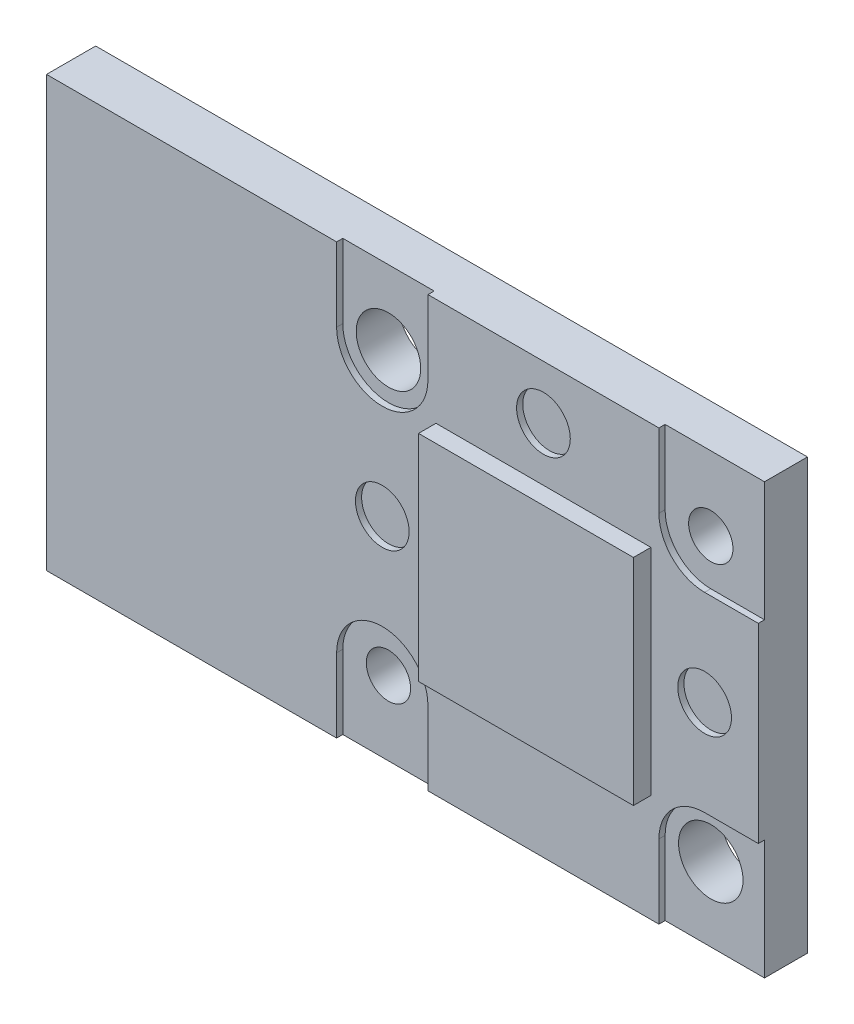
ISO-10303-21;
HEADER;
FILE_DESCRIPTION(('STEP AP214'),'2;1');
FILE_NAME('part.step','',(''),(''),'','','');
FILE_SCHEMA(('AUTOMOTIVE_DESIGN { 1 0 10303 214 1 1 1 1 }'));
ENDSEC;
DATA;
#1=APPLICATION_CONTEXT('core data for automotive mechanical design processes');
#2=APPLICATION_PROTOCOL_DEFINITION('international standard','automotive_design',2000,#1);
#3=PRODUCT_CONTEXT('',#1,'mechanical');
#4=PRODUCT('Part','Part','',(#3));
#5=PRODUCT_RELATED_PRODUCT_CATEGORY('part','',(#4));
#6=PRODUCT_DEFINITION_FORMATION('','',#4);
#7=PRODUCT_DEFINITION_CONTEXT('part definition',#1,'design');
#8=PRODUCT_DEFINITION('design','',#6,#7);
#9=PRODUCT_DEFINITION_SHAPE('','',#8);
#10=(LENGTH_UNIT() NAMED_UNIT(*) SI_UNIT(.MILLI.,.METRE.));
#11=(NAMED_UNIT(*) PLANE_ANGLE_UNIT() SI_UNIT($,.RADIAN.));
#12=(NAMED_UNIT(*) SI_UNIT($,.STERADIAN.) SOLID_ANGLE_UNIT());
#13=UNCERTAINTY_MEASURE_WITH_UNIT(LENGTH_MEASURE(1.E-05),#10,'distance_accuracy_value','');
#14=(GEOMETRIC_REPRESENTATION_CONTEXT(3) GLOBAL_UNCERTAINTY_ASSIGNED_CONTEXT((#13)) GLOBAL_UNIT_ASSIGNED_CONTEXT((#10,
#11,#12)) REPRESENTATION_CONTEXT('',''));
#15=CARTESIAN_POINT('',(0.,0.,0.));
#16=DIRECTION('',(0.,0.,1.));
#17=DIRECTION('',(1.,0.,0.));
#18=AXIS2_PLACEMENT_3D('',#15,#16,#17);
#19=CARTESIAN_POINT('',(1.25,4.,2.48));
#20=DIRECTION('',(0.,1.,0.));
#21=DIRECTION('',(0.,0.,1.));
#22=AXIS2_PLACEMENT_3D('',#19,#20,#21);
#23=PLANE('',#22);
#24=DIRECTION('',(1.,0.,0.));
#25=VECTOR('',#24,1.);
#26=CARTESIAN_POINT('',(1.25,4.,1.83));
#27=LINE('',#26,#25);
#28=CARTESIAN_POINT('',(1.25,4.,1.83));
#29=VERTEX_POINT('',#28);
#30=CARTESIAN_POINT('',(9.25,4.,1.83));
#31=VERTEX_POINT('',#30);
#32=EDGE_CURVE('E111',#29,#31,#27,.T.);
#33=ORIENTED_EDGE('',*,*,#32,.F.);
#34=DIRECTION('',(0.,0.,-1.));
#35=VECTOR('',#34,1.);
#36=CARTESIAN_POINT('',(1.25,4.,2.48));
#37=LINE('',#36,#35);
#38=CARTESIAN_POINT('',(1.25,4.,2.48));
#39=VERTEX_POINT('',#38);
#40=EDGE_CURVE('E12',#39,#29,#37,.T.);
#41=ORIENTED_EDGE('',*,*,#40,.F.);
#42=DIRECTION('',(1.,0.,0.));
#43=VECTOR('',#42,1.);
#44=CARTESIAN_POINT('',(1.25,4.,2.48));
#45=LINE('',#44,#43);
#46=CARTESIAN_POINT('',(9.25,4.,2.48));
#47=VERTEX_POINT('',#46);
#48=EDGE_CURVE('E106',#39,#47,#45,.T.);
#49=ORIENTED_EDGE('',*,*,#48,.T.);
#50=DIRECTION('',(0.,0.,-1.));
#51=VECTOR('',#50,1.);
#52=CARTESIAN_POINT('',(9.25,4.,2.48));
#53=LINE('',#52,#51);
#54=EDGE_CURVE('E49',#47,#31,#53,.T.);
#55=ORIENTED_EDGE('',*,*,#54,.T.);
#56=EDGE_LOOP('',(#33,#41,#49,#55));
#57=FACE_BOUND('',#56,.T.);
#58=ADVANCED_FACE('F46',(#57),#23,.T.);
#59=CARTESIAN_POINT('',(1.25,4.,2.48));
#60=DIRECTION('',(1.,0.,0.));
#61=DIRECTION('',(0.,1.,0.));
#62=AXIS2_PLACEMENT_3D('',#59,#60,#61);
#63=PLANE('',#62);
#64=DIRECTION('',(0.,-1.,0.));
#65=VECTOR('',#64,1.);
#66=CARTESIAN_POINT('',(1.25,4.,1.83));
#67=LINE('',#66,#65);
#68=CARTESIAN_POINT('',(1.25,-4.,1.83));
#69=VERTEX_POINT('',#68);
#70=EDGE_CURVE('E79',#29,#69,#67,.T.);
#71=ORIENTED_EDGE('',*,*,#70,.T.);
#72=DIRECTION('',(0.,0.,-1.));
#73=VECTOR('',#72,1.);
#74=CARTESIAN_POINT('',(1.25,-4.,2.48));
#75=LINE('',#74,#73);
#76=CARTESIAN_POINT('',(1.25,-4.,2.48));
#77=VERTEX_POINT('',#76);
#78=EDGE_CURVE('E55',#77,#69,#75,.T.);
#79=ORIENTED_EDGE('',*,*,#78,.F.);
#80=DIRECTION('',(0.,-1.,0.));
#81=VECTOR('',#80,1.);
#82=CARTESIAN_POINT('',(1.25,4.,2.48));
#83=LINE('',#82,#81);
#84=EDGE_CURVE('E96',#39,#77,#83,.T.);
#85=ORIENTED_EDGE('',*,*,#84,.F.);
#86=ORIENTED_EDGE('',*,*,#40,.T.);
#87=EDGE_LOOP('',(#71,#79,#85,#86));
#88=FACE_BOUND('',#87,.T.);
#89=ADVANCED_FACE('F121',(#88),#63,.F.);
#90=CARTESIAN_POINT('',(1.25,-4.,2.48));
#91=DIRECTION('',(0.,1.,0.));
#92=DIRECTION('',(0.,0.,1.));
#93=AXIS2_PLACEMENT_3D('',#90,#91,#92);
#94=PLANE('',#93);
#95=DIRECTION('',(1.,0.,0.));
#96=VECTOR('',#95,1.);
#97=CARTESIAN_POINT('',(1.25,-4.,1.83));
#98=LINE('',#97,#96);
#99=CARTESIAN_POINT('',(9.25000000000001,-4.,1.83));
#100=VERTEX_POINT('',#99);
#101=EDGE_CURVE('E103',#69,#100,#98,.T.);
#102=ORIENTED_EDGE('',*,*,#101,.T.);
#103=DIRECTION('',(0.,0.,-1.));
#104=VECTOR('',#103,1.);
#105=CARTESIAN_POINT('',(9.25000000000001,-4.,2.48));
#106=LINE('',#105,#104);
#107=CARTESIAN_POINT('',(9.25000000000001,-4.,2.48));
#108=VERTEX_POINT('',#107);
#109=EDGE_CURVE('E100',#108,#100,#106,.T.);
#110=ORIENTED_EDGE('',*,*,#109,.F.);
#111=DIRECTION('',(1.,0.,0.));
#112=VECTOR('',#111,1.);
#113=CARTESIAN_POINT('',(1.25,-4.,2.48));
#114=LINE('',#113,#112);
#115=EDGE_CURVE('E91',#77,#108,#114,.T.);
#116=ORIENTED_EDGE('',*,*,#115,.F.);
#117=ORIENTED_EDGE('',*,*,#78,.T.);
#118=EDGE_LOOP('',(#102,#110,#116,#117));
#119=FACE_BOUND('',#118,.T.);
#120=ADVANCED_FACE('F101',(#119),#94,.F.);
#121=CARTESIAN_POINT('',(9.25,4.,2.48));
#122=DIRECTION('',(1.,0.,0.));
#123=DIRECTION('',(0.,1.,0.));
#124=AXIS2_PLACEMENT_3D('',#121,#122,#123);
#125=PLANE('',#124);
#126=DIRECTION('',(0.,-1.,0.));
#127=VECTOR('',#126,1.);
#128=CARTESIAN_POINT('',(9.25,4.,1.83));
#129=LINE('',#128,#127);
#130=EDGE_CURVE('E114',#31,#100,#129,.T.);
#131=ORIENTED_EDGE('',*,*,#130,.F.);
#132=ORIENTED_EDGE('',*,*,#54,.F.);
#133=DIRECTION('',(0.,-1.,0.));
#134=VECTOR('',#133,1.);
#135=CARTESIAN_POINT('',(9.25,4.,2.48));
#136=LINE('',#135,#134);
#137=EDGE_CURVE('E95',#47,#108,#136,.T.);
#138=ORIENTED_EDGE('',*,*,#137,.T.);
#139=ORIENTED_EDGE('',*,*,#109,.T.);
#140=EDGE_LOOP('',(#131,#132,#138,#139));
#141=FACE_BOUND('',#140,.T.);
#142=ADVANCED_FACE('F105',(#141),#125,.T.);
#143=CARTESIAN_POINT('',(0.,0.,2.48));
#144=DIRECTION('',(0.,0.,-1.));
#145=DIRECTION('',(-1.,0.,0.));
#146=AXIS2_PLACEMENT_3D('',#143,#144,#145);
#147=PLANE('',#146);
#148=ORIENTED_EDGE('',*,*,#48,.F.);
#149=ORIENTED_EDGE('',*,*,#84,.T.);
#150=ORIENTED_EDGE('',*,*,#115,.T.);
#151=ORIENTED_EDGE('',*,*,#137,.F.);
#152=EDGE_LOOP('',(#148,#149,#150,#151));
#153=FACE_BOUND('',#152,.T.);
#154=ADVANCED_FACE('F94',(#153),#147,.F.);
#155=CARTESIAN_POINT('',(0.,0.,1.83));
#156=DIRECTION('',(0.,0.,-1.));
#157=DIRECTION('',(-1.,0.,0.));
#158=AXIS2_PLACEMENT_3D('',#155,#156,#157);
#159=PLANE('',#158);
#160=ORIENTED_EDGE('',*,*,#32,.T.);
#161=ORIENTED_EDGE('',*,*,#130,.T.);
#162=ORIENTED_EDGE('',*,*,#101,.F.);
#163=ORIENTED_EDGE('',*,*,#70,.F.);
#164=EDGE_LOOP('',(#160,#161,#162,#163));
#165=FACE_BOUND('',#164,.T.);
#166=ADVANCED_FACE('F119',(#165),#159,.T.);
#167=CLOSED_SHELL('',(#58,#89,#120,#142,#154,#166));
#168=MANIFOLD_SOLID_BREP('B2',#167);
#169=CARTESIAN_POINT('',(6.25,1.35,2.03));
#170=DIRECTION('',(-1.,0.,0.));
#171=DIRECTION('',(0.,0.,1.));
#172=AXIS2_PLACEMENT_3D('',#169,#170,#171);
#173=PLANE('',#172);
#174=DIRECTION('',(0.,1.,0.));
#175=VECTOR('',#174,1.);
#176=CARTESIAN_POINT('',(6.25,1.35,1.83));
#177=LINE('',#176,#175);
#178=CARTESIAN_POINT('',(6.25,-1.35,1.83));
#179=VERTEX_POINT('',#178);
#180=CARTESIAN_POINT('',(6.25,1.35,1.83));
#181=VERTEX_POINT('',#180);
#182=EDGE_CURVE('E242',#179,#181,#177,.T.);
#183=ORIENTED_EDGE('',*,*,#182,.T.);
#184=DIRECTION('',(0.,0.,-1.));
#185=VECTOR('',#184,1.);
#186=CARTESIAN_POINT('',(6.25,1.35,2.03));
#187=LINE('',#186,#185);
#188=CARTESIAN_POINT('',(6.25,1.35,2.03));
#189=VERTEX_POINT('',#188);
#190=EDGE_CURVE('E44',#189,#181,#187,.T.);
#191=ORIENTED_EDGE('',*,*,#190,.F.);
#192=DIRECTION('',(0.,1.,0.));
#193=VECTOR('',#192,1.);
#194=CARTESIAN_POINT('',(6.25,1.35,2.03));
#195=LINE('',#194,#193);
#196=CARTESIAN_POINT('',(6.25,-1.35,2.03));
#197=VERTEX_POINT('',#196);
#198=EDGE_CURVE('E230',#197,#189,#195,.T.);
#199=ORIENTED_EDGE('',*,*,#198,.F.);
#200=DIRECTION('',(0.,0.,-1.));
#201=VECTOR('',#200,1.);
#202=CARTESIAN_POINT('',(6.25,-1.35,2.03));
#203=LINE('',#202,#201);
#204=EDGE_CURVE('E238',#197,#179,#203,.T.);
#205=ORIENTED_EDGE('',*,*,#204,.T.);
#206=EDGE_LOOP('',(#183,#191,#199,#205));
#207=FACE_BOUND('',#206,.T.);
#208=ADVANCED_FACE('F179',(#207),#173,.F.);
#209=CARTESIAN_POINT('',(4.25,1.35,2.03));
#210=DIRECTION('',(0.,-1.,0.));
#211=DIRECTION('',(0.,0.,-1.));
#212=AXIS2_PLACEMENT_3D('',#209,#210,#211);
#213=PLANE('',#212);
#214=DIRECTION('',(-1.,0.,0.));
#215=VECTOR('',#214,1.);
#216=CARTESIAN_POINT('',(4.25,1.35,1.83));
#217=LINE('',#216,#215);
#218=CARTESIAN_POINT('',(4.25,1.35,1.83));
#219=VERTEX_POINT('',#218);
#220=EDGE_CURVE('E234',#181,#219,#217,.T.);
#221=ORIENTED_EDGE('',*,*,#220,.T.);
#222=DIRECTION('',(0.,0.,-1.));
#223=VECTOR('',#222,1.);
#224=CARTESIAN_POINT('',(4.25,1.35,2.03));
#225=LINE('',#224,#223);
#226=CARTESIAN_POINT('',(4.25,1.35,2.03));
#227=VERTEX_POINT('',#226);
#228=EDGE_CURVE('E187',#227,#219,#225,.T.);
#229=ORIENTED_EDGE('',*,*,#228,.F.);
#230=DIRECTION('',(-1.,0.,0.));
#231=VECTOR('',#230,1.);
#232=CARTESIAN_POINT('',(4.25,1.35,2.03));
#233=LINE('',#232,#231);
#234=EDGE_CURVE('E225',#189,#227,#233,.T.);
#235=ORIENTED_EDGE('',*,*,#234,.F.);
#236=ORIENTED_EDGE('',*,*,#190,.T.);
#237=EDGE_LOOP('',(#221,#229,#235,#236));
#238=FACE_BOUND('',#237,.T.);
#239=ADVANCED_FACE('F233',(#238),#213,.F.);
#240=CARTESIAN_POINT('',(4.25,1.35,2.03));
#241=DIRECTION('',(1.,0.,0.));
#242=DIRECTION('',(0.,0.,-1.));
#243=AXIS2_PLACEMENT_3D('',#240,#241,#242);
#244=PLANE('',#243);
#245=DIRECTION('',(0.,-1.,0.));
#246=VECTOR('',#245,1.);
#247=CARTESIAN_POINT('',(4.25,1.35,1.83));
#248=LINE('',#247,#246);
#249=CARTESIAN_POINT('',(4.25,-1.35,1.83));
#250=VERTEX_POINT('',#249);
#251=EDGE_CURVE('E212',#219,#250,#248,.T.);
#252=ORIENTED_EDGE('',*,*,#251,.T.);
#253=DIRECTION('',(0.,0.,-1.));
#254=VECTOR('',#253,1.);
#255=CARTESIAN_POINT('',(4.25,-1.35,2.03));
#256=LINE('',#255,#254);
#257=CARTESIAN_POINT('',(4.25,-1.35,2.03));
#258=VERTEX_POINT('',#257);
#259=EDGE_CURVE('E235',#258,#250,#256,.T.);
#260=ORIENTED_EDGE('',*,*,#259,.F.);
#261=DIRECTION('',(0.,-1.,0.));
#262=VECTOR('',#261,1.);
#263=CARTESIAN_POINT('',(4.25,1.35,2.03));
#264=LINE('',#263,#262);
#265=EDGE_CURVE('E228',#227,#258,#264,.T.);
#266=ORIENTED_EDGE('',*,*,#265,.F.);
#267=ORIENTED_EDGE('',*,*,#228,.T.);
#268=EDGE_LOOP('',(#252,#260,#266,#267));
#269=FACE_BOUND('',#268,.T.);
#270=ADVANCED_FACE('F236',(#269),#244,.F.);
#271=CARTESIAN_POINT('',(4.25,-1.35,2.03));
#272=DIRECTION('',(0.,1.,0.));
#273=DIRECTION('',(0.,0.,1.));
#274=AXIS2_PLACEMENT_3D('',#271,#272,#273);
#275=PLANE('',#274);
#276=DIRECTION('',(1.,0.,0.));
#277=VECTOR('',#276,1.);
#278=CARTESIAN_POINT('',(4.25,-1.35,1.83));
#279=LINE('',#278,#277);
#280=EDGE_CURVE('E218',#250,#179,#279,.T.);
#281=ORIENTED_EDGE('',*,*,#280,.T.);
#282=ORIENTED_EDGE('',*,*,#204,.F.);
#283=DIRECTION('',(1.,0.,0.));
#284=VECTOR('',#283,1.);
#285=CARTESIAN_POINT('',(4.25,-1.35,2.03));
#286=LINE('',#285,#284);
#287=EDGE_CURVE('E195',#258,#197,#286,.T.);
#288=ORIENTED_EDGE('',*,*,#287,.F.);
#289=ORIENTED_EDGE('',*,*,#259,.T.);
#290=EDGE_LOOP('',(#281,#282,#288,#289));
#291=FACE_BOUND('',#290,.T.);
#292=ADVANCED_FACE('F249',(#291),#275,.F.);
#293=CARTESIAN_POINT('',(0.,0.,2.03));
#294=DIRECTION('',(0.,0.,1.));
#295=DIRECTION('',(1.,0.,0.));
#296=AXIS2_PLACEMENT_3D('',#293,#294,#295);
#297=PLANE('',#296);
#298=ORIENTED_EDGE('',*,*,#198,.T.);
#299=ORIENTED_EDGE('',*,*,#234,.T.);
#300=ORIENTED_EDGE('',*,*,#265,.T.);
#301=ORIENTED_EDGE('',*,*,#287,.T.);
#302=EDGE_LOOP('',(#298,#299,#300,#301));
#303=FACE_BOUND('',#302,.T.);
#304=ADVANCED_FACE('F226',(#303),#297,.T.);
#305=CARTESIAN_POINT('',(0.,0.,1.83));
#306=DIRECTION('',(0.,0.,1.));
#307=DIRECTION('',(1.,0.,0.));
#308=AXIS2_PLACEMENT_3D('',#305,#306,#307);
#309=PLANE('',#308);
#310=ORIENTED_EDGE('',*,*,#182,.F.);
#311=ORIENTED_EDGE('',*,*,#280,.F.);
#312=ORIENTED_EDGE('',*,*,#251,.F.);
#313=ORIENTED_EDGE('',*,*,#220,.F.);
#314=EDGE_LOOP('',(#310,#311,#312,#313));
#315=FACE_BOUND('',#314,.T.);
#316=ADVANCED_FACE('F252',(#315),#309,.F.);
#317=CLOSED_SHELL('',(#208,#239,#270,#292,#304,#316));
#318=MANIFOLD_SOLID_BREP('B6',#317);
#319=CARTESIAN_POINT('',(0.,0.,1.6));
#320=DIRECTION('',(0.,0.,1.));
#321=DIRECTION('',(1.,0.,0.));
#322=AXIS2_PLACEMENT_3D('',#319,#320,#321);
#323=PLANE('',#322);
#324=DIRECTION('',(1.,0.,0.));
#325=VECTOR('',#324,1.);
#326=CARTESIAN_POINT('',(11.25,-3.55,1.6));
#327=LINE('',#326,#325);
#328=CARTESIAN_POINT('',(11.25,-3.55,1.6));
#329=VERTEX_POINT('',#328);
#330=CARTESIAN_POINT('',(13.25,-3.55,1.6));
#331=VERTEX_POINT('',#330);
#332=EDGE_CURVE('E318',#329,#331,#327,.T.);
#333=ORIENTED_EDGE('',*,*,#332,.F.);
#334=CARTESIAN_POINT('',(11.25,-5.25,1.6));
#335=DIRECTION('',(0.,0.,-1.));
#336=DIRECTION('',(1.,0.,0.));
#337=AXIS2_PLACEMENT_3D('',#334,#335,#336);
#338=CIRCLE('',#337,1.7);
#339=CARTESIAN_POINT('',(9.55000000000001,-5.25,1.6));
#340=VERTEX_POINT('',#339);
#341=EDGE_CURVE('E322',#340,#329,#338,.T.);
#342=ORIENTED_EDGE('',*,*,#341,.F.);
#343=DIRECTION('',(0.,1.,0.));
#344=VECTOR('',#343,1.);
#345=CARTESIAN_POINT('',(9.55000000000001,-5.25,1.6));
#346=LINE('',#345,#344);
#347=CARTESIAN_POINT('',(9.55000000000001,-8.,1.6));
#348=VERTEX_POINT('',#347);
#349=EDGE_CURVE('E552',#348,#340,#346,.T.);
#350=ORIENTED_EDGE('',*,*,#349,.F.);
#351=DIRECTION('',(1.,0.,0.));
#352=VECTOR('',#351,1.);
#353=CARTESIAN_POINT('',(-13.25,-8.,1.6));
#354=LINE('',#353,#352);
#355=CARTESIAN_POINT('',(13.25,-8.,1.6));
#356=VERTEX_POINT('',#355);
#357=EDGE_CURVE('E500',#348,#356,#354,.T.);
#358=ORIENTED_EDGE('',*,*,#357,.T.);
#359=DIRECTION('',(0.,1.,0.));
#360=VECTOR('',#359,1.);
#361=CARTESIAN_POINT('',(13.25,8.,1.6));
#362=LINE('',#361,#360);
#363=EDGE_CURVE('E494',#356,#331,#362,.T.);
#364=ORIENTED_EDGE('',*,*,#363,.T.);
#365=EDGE_LOOP('',(#333,#342,#350,#358,#364));
#366=FACE_BOUND('',#365,.T.);
#367=CARTESIAN_POINT('',(11.25,-5.25,1.6));
#368=DIRECTION('',(0.,0.,1.));
#369=DIRECTION('',(1.,0.,0.));
#370=AXIS2_PLACEMENT_3D('',#367,#368,#369);
#371=CIRCLE('',#370,1.2);
#372=CARTESIAN_POINT('',(12.45,-5.25,1.6));
#373=VERTEX_POINT('',#372);
#374=EDGE_CURVE('E483',#373,#373,#371,.T.);
#375=ORIENTED_EDGE('',*,*,#374,.F.);
#376=EDGE_LOOP('',(#375));
#377=FACE_BOUND('',#376,.T.);
#378=ADVANCED_FACE('F303',(#366,#377),#323,.T.);
#379=DIRECTION('',(0.,-1.,0.));
#380=VECTOR('',#379,1.);
#381=CARTESIAN_POINT('',(0.950000000000006,-5.25,1.6));
#382=LINE('',#381,#380);
#383=CARTESIAN_POINT('',(0.950000000000006,-5.25,1.6));
#384=VERTEX_POINT('',#383);
#385=CARTESIAN_POINT('',(0.950000000000006,-8.,1.6));
#386=VERTEX_POINT('',#385);
#387=EDGE_CURVE('E622',#384,#386,#382,.T.);
#388=ORIENTED_EDGE('',*,*,#387,.F.);
#389=CARTESIAN_POINT('',(-0.749999999999994,-5.25,1.6));
#390=DIRECTION('',(0.,0.,-1.));
#391=DIRECTION('',(1.,0.,0.));
#392=AXIS2_PLACEMENT_3D('',#389,#390,#391);
#393=CIRCLE('',#392,1.7);
#394=CARTESIAN_POINT('',(-2.44999999999999,-5.25,1.6));
#395=VERTEX_POINT('',#394);
#396=EDGE_CURVE('E615',#395,#384,#393,.T.);
#397=ORIENTED_EDGE('',*,*,#396,.F.);
#398=DIRECTION('',(0.,1.,0.));
#399=VECTOR('',#398,1.);
#400=CARTESIAN_POINT('',(-2.44999999999999,-5.25,1.6));
#401=LINE('',#400,#399);
#402=CARTESIAN_POINT('',(-2.44999999999999,-8.,1.6));
#403=VERTEX_POINT('',#402);
#404=EDGE_CURVE('E611',#403,#395,#401,.T.);
#405=ORIENTED_EDGE('',*,*,#404,.F.);
#406=EDGE_CURVE('E502',#403,#386,#354,.T.);
#407=ORIENTED_EDGE('',*,*,#406,.T.);
#408=EDGE_LOOP('',(#388,#397,#405,#407));
#409=FACE_BOUND('',#408,.T.);
#410=CARTESIAN_POINT('',(-0.749999999999994,-5.25,1.6));
#411=DIRECTION('',(0.,0.,1.));
#412=DIRECTION('',(1.,0.,0.));
#413=AXIS2_PLACEMENT_3D('',#410,#411,#412);
#414=CIRCLE('',#413,0.825);
#415=CARTESIAN_POINT('',(0.075000000000006,-5.25,1.6));
#416=VERTEX_POINT('',#415);
#417=EDGE_CURVE('E464',#416,#416,#414,.T.);
#418=ORIENTED_EDGE('',*,*,#417,.F.);
#419=EDGE_LOOP('',(#418));
#420=FACE_BOUND('',#419,.T.);
#421=ADVANCED_FACE('F676',(#409,#420),#323,.T.);
#422=DIRECTION('',(0.,1.,0.));
#423=VECTOR('',#422,1.);
#424=CARTESIAN_POINT('',(-2.45,5.25,1.6));
#425=LINE('',#424,#423);
#426=CARTESIAN_POINT('',(-2.45,5.25,1.6));
#427=VERTEX_POINT('',#426);
#428=CARTESIAN_POINT('',(-2.45,8.,1.6));
#429=VERTEX_POINT('',#428);
#430=EDGE_CURVE('E605',#427,#429,#425,.T.);
#431=ORIENTED_EDGE('',*,*,#430,.F.);
#432=CARTESIAN_POINT('',(-0.749999999999995,5.25,1.6));
#433=DIRECTION('',(0.,0.,-1.));
#434=DIRECTION('',(1.,0.,0.));
#435=AXIS2_PLACEMENT_3D('',#432,#433,#434);
#436=CIRCLE('',#435,1.7);
#437=CARTESIAN_POINT('',(0.950000000000005,5.25,1.6));
#438=VERTEX_POINT('',#437);
#439=EDGE_CURVE('E612',#438,#427,#436,.T.);
#440=ORIENTED_EDGE('',*,*,#439,.F.);
#441=DIRECTION('',(0.,-1.,0.));
#442=VECTOR('',#441,1.);
#443=CARTESIAN_POINT('',(0.950000000000005,5.25,1.6));
#444=LINE('',#443,#442);
#445=CARTESIAN_POINT('',(0.950000000000005,8.,1.6));
#446=VERTEX_POINT('',#445);
#447=EDGE_CURVE('E596',#446,#438,#444,.T.);
#448=ORIENTED_EDGE('',*,*,#447,.F.);
#449=DIRECTION('',(-1.,0.,0.));
#450=VECTOR('',#449,1.);
#451=CARTESIAN_POINT('',(-13.25,8.,1.6));
#452=LINE('',#451,#450);
#453=EDGE_CURVE('E496',#446,#429,#452,.T.);
#454=ORIENTED_EDGE('',*,*,#453,.T.);
#455=EDGE_LOOP('',(#431,#440,#448,#454));
#456=FACE_BOUND('',#455,.T.);
#457=CARTESIAN_POINT('',(-0.749999999999995,5.25,1.6));
#458=DIRECTION('',(0.,0.,1.));
#459=DIRECTION('',(1.,0.,0.));
#460=AXIS2_PLACEMENT_3D('',#457,#458,#459);
#461=CIRCLE('',#460,1.2);
#462=CARTESIAN_POINT('',(0.450000000000005,5.25,1.6));
#463=VERTEX_POINT('',#462);
#464=EDGE_CURVE('E477',#463,#463,#461,.T.);
#465=ORIENTED_EDGE('',*,*,#464,.F.);
#466=EDGE_LOOP('',(#465));
#467=FACE_BOUND('',#466,.T.);
#468=ADVANCED_FACE('F603',(#456,#467),#323,.T.);
#469=CARTESIAN_POINT('',(13.25,8.,1.6));
#470=DIRECTION('',(-1.,0.,0.));
#471=DIRECTION('',(0.,0.,1.));
#472=AXIS2_PLACEMENT_3D('',#469,#470,#471);
#473=PLANE('',#472);
#474=DIRECTION('',(0.,1.,0.));
#475=VECTOR('',#474,1.);
#476=CARTESIAN_POINT('',(13.25,8.,0.));
#477=LINE('',#476,#475);
#478=CARTESIAN_POINT('',(13.25,-8.,0.));
#479=VERTEX_POINT('',#478);
#480=CARTESIAN_POINT('',(13.25,8.,0.));
#481=VERTEX_POINT('',#480);
#482=EDGE_CURVE('E491',#479,#481,#477,.T.);
#483=ORIENTED_EDGE('',*,*,#482,.T.);
#484=DIRECTION('',(0.,0.,-1.));
#485=VECTOR('',#484,1.);
#486=CARTESIAN_POINT('',(13.25,8.,1.6));
#487=LINE('',#486,#485);
#488=CARTESIAN_POINT('',(13.25,8.,1.6));
#489=VERTEX_POINT('',#488);
#490=EDGE_CURVE('E177',#489,#481,#487,.T.);
#491=ORIENTED_EDGE('',*,*,#490,.F.);
#492=CARTESIAN_POINT('',(13.25,3.55,1.6));
#493=VERTEX_POINT('',#492);
#494=EDGE_CURVE('E497',#493,#489,#362,.T.);
#495=ORIENTED_EDGE('',*,*,#494,.F.);
#496=DIRECTION('',(0.,0.,-1.));
#497=VECTOR('',#496,1.);
#498=CARTESIAN_POINT('',(13.25,3.55,1.83));
#499=LINE('',#498,#497);
#500=CARTESIAN_POINT('',(13.25,3.55,1.83));
#501=VERTEX_POINT('',#500);
#502=EDGE_CURVE('E558',#501,#493,#499,.T.);
#503=ORIENTED_EDGE('',*,*,#502,.F.);
#504=DIRECTION('',(0.,1.,0.));
#505=VECTOR('',#504,1.);
#506=CARTESIAN_POINT('',(13.25,-3.55,1.83));
#507=LINE('',#506,#505);
#508=CARTESIAN_POINT('',(13.25,-3.55,1.83));
#509=VERTEX_POINT('',#508);
#510=EDGE_CURVE('E636',#509,#501,#507,.T.);
#511=ORIENTED_EDGE('',*,*,#510,.F.);
#512=DIRECTION('',(0.,0.,-1.));
#513=VECTOR('',#512,1.);
#514=CARTESIAN_POINT('',(13.25,-3.55,1.83));
#515=LINE('',#514,#513);
#516=EDGE_CURVE('E541',#509,#331,#515,.T.);
#517=ORIENTED_EDGE('',*,*,#516,.T.);
#518=ORIENTED_EDGE('',*,*,#363,.F.);
#519=DIRECTION('',(0.,0.,-1.));
#520=VECTOR('',#519,1.);
#521=CARTESIAN_POINT('',(13.25,-8.,1.6));
#522=LINE('',#521,#520);
#523=EDGE_CURVE('E511',#356,#479,#522,.T.);
#524=ORIENTED_EDGE('',*,*,#523,.T.);
#525=EDGE_LOOP('',(#483,#491,#495,#503,#511,#517,#518,#524));
#526=FACE_BOUND('',#525,.T.);
#527=ADVANCED_FACE('F305',(#526),#473,.F.);
#528=CARTESIAN_POINT('',(-13.25,8.,1.6));
#529=DIRECTION('',(0.,-1.,0.));
#530=DIRECTION('',(0.,0.,-1.));
#531=AXIS2_PLACEMENT_3D('',#528,#529,#530);
#532=PLANE('',#531);
#533=DIRECTION('',(-1.,0.,0.));
#534=VECTOR('',#533,1.);
#535=CARTESIAN_POINT('',(-13.25,8.,0.));
#536=LINE('',#535,#534);
#537=CARTESIAN_POINT('',(-13.25,8.,0.));
#538=VERTEX_POINT('',#537);
#539=EDGE_CURVE('E505',#481,#538,#536,.T.);
#540=ORIENTED_EDGE('',*,*,#539,.T.);
#541=DIRECTION('',(0.,0.,-1.));
#542=VECTOR('',#541,1.);
#543=CARTESIAN_POINT('',(-13.25,8.,1.6));
#544=LINE('',#543,#542);
#545=CARTESIAN_POINT('',(-13.25,8.,1.83));
#546=VERTEX_POINT('',#545);
#547=EDGE_CURVE('E311',#546,#538,#544,.T.);
#548=ORIENTED_EDGE('',*,*,#547,.F.);
#549=DIRECTION('',(-1.,0.,0.));
#550=VECTOR('',#549,1.);
#551=CARTESIAN_POINT('',(-2.45,8.,1.83));
#552=LINE('',#551,#550);
#553=CARTESIAN_POINT('',(-2.45,8.,1.83));
#554=VERTEX_POINT('',#553);
#555=EDGE_CURVE('E724',#554,#546,#552,.T.);
#556=ORIENTED_EDGE('',*,*,#555,.F.);
#557=DIRECTION('',(0.,0.,-1.));
#558=VECTOR('',#557,1.);
#559=CARTESIAN_POINT('',(-2.45,8.,1.83));
#560=LINE('',#559,#558);
#561=EDGE_CURVE('E581',#554,#429,#560,.T.);
#562=ORIENTED_EDGE('',*,*,#561,.T.);
#563=ORIENTED_EDGE('',*,*,#453,.F.);
#564=DIRECTION('',(0.,0.,-1.));
#565=VECTOR('',#564,1.);
#566=CARTESIAN_POINT('',(0.950000000000005,8.,1.83));
#567=LINE('',#566,#565);
#568=CARTESIAN_POINT('',(0.950000000000005,8.,1.83));
#569=VERTEX_POINT('',#568);
#570=EDGE_CURVE('E469',#569,#446,#567,.T.);
#571=ORIENTED_EDGE('',*,*,#570,.F.);
#572=DIRECTION('',(-1.,0.,0.));
#573=VECTOR('',#572,1.);
#574=CARTESIAN_POINT('',(0.950000000000005,8.,1.83));
#575=LINE('',#574,#573);
#576=CARTESIAN_POINT('',(9.55000000000001,8.,1.83));
#577=VERTEX_POINT('',#576);
#578=EDGE_CURVE('E449',#577,#569,#575,.T.);
#579=ORIENTED_EDGE('',*,*,#578,.F.);
#580=DIRECTION('',(0.,0.,-1.));
#581=VECTOR('',#580,1.);
#582=CARTESIAN_POINT('',(9.55000000000001,8.,1.83));
#583=LINE('',#582,#581);
#584=CARTESIAN_POINT('',(9.55000000000001,8.,1.6));
#585=VERTEX_POINT('',#584);
#586=EDGE_CURVE('E446',#577,#585,#583,.T.);
#587=ORIENTED_EDGE('',*,*,#586,.T.);
#588=EDGE_CURVE('E498',#489,#585,#452,.T.);
#589=ORIENTED_EDGE('',*,*,#588,.F.);
#590=ORIENTED_EDGE('',*,*,#490,.T.);
#591=EDGE_LOOP('',(#540,#548,#556,#562,#563,#571,#579,#587,#589,#590));
#592=FACE_BOUND('',#591,.T.);
#593=ADVANCED_FACE('F599',(#592),#532,.F.);
#594=CARTESIAN_POINT('',(-13.25,8.,1.6));
#595=DIRECTION('',(1.,0.,0.));
#596=DIRECTION('',(0.,1.,0.));
#597=AXIS2_PLACEMENT_3D('',#594,#595,#596);
#598=PLANE('',#597);
#599=DIRECTION('',(0.,-1.,0.));
#600=VECTOR('',#599,1.);
#601=CARTESIAN_POINT('',(-13.25,8.,0.));
#602=LINE('',#601,#600);
#603=CARTESIAN_POINT('',(-13.25,-8.,0.));
#604=VERTEX_POINT('',#603);
#605=EDGE_CURVE('E507',#538,#604,#602,.T.);
#606=ORIENTED_EDGE('',*,*,#605,.T.);
#607=DIRECTION('',(0.,0.,-1.));
#608=VECTOR('',#607,1.);
#609=CARTESIAN_POINT('',(-13.25,-8.,1.6));
#610=LINE('',#609,#608);
#611=CARTESIAN_POINT('',(-13.25,-8.,1.83));
#612=VERTEX_POINT('',#611);
#613=EDGE_CURVE('E514',#612,#604,#610,.T.);
#614=ORIENTED_EDGE('',*,*,#613,.F.);
#615=DIRECTION('',(0.,-1.,0.));
#616=VECTOR('',#615,1.);
#617=CARTESIAN_POINT('',(-13.25,8.,1.83));
#618=LINE('',#617,#616);
#619=EDGE_CURVE('E522',#546,#612,#618,.T.);
#620=ORIENTED_EDGE('',*,*,#619,.F.);
#621=ORIENTED_EDGE('',*,*,#547,.T.);
#622=EDGE_LOOP('',(#606,#614,#620,#621));
#623=FACE_BOUND('',#622,.T.);
#624=ADVANCED_FACE('F520',(#623),#598,.F.);
#625=CARTESIAN_POINT('',(-13.25,-8.,1.6));
#626=DIRECTION('',(0.,1.,0.));
#627=DIRECTION('',(0.,0.,1.));
#628=AXIS2_PLACEMENT_3D('',#625,#626,#627);
#629=PLANE('',#628);
#630=DIRECTION('',(1.,0.,0.));
#631=VECTOR('',#630,1.);
#632=CARTESIAN_POINT('',(-13.25,-8.,0.));
#633=LINE('',#632,#631);
#634=EDGE_CURVE('E509',#604,#479,#633,.T.);
#635=ORIENTED_EDGE('',*,*,#634,.T.);
#636=ORIENTED_EDGE('',*,*,#523,.F.);
#637=ORIENTED_EDGE('',*,*,#357,.F.);
#638=DIRECTION('',(0.,0.,-1.));
#639=VECTOR('',#638,1.);
#640=CARTESIAN_POINT('',(9.55000000000001,-8.,1.83));
#641=LINE('',#640,#639);
#642=CARTESIAN_POINT('',(9.55000000000001,-8.,1.83));
#643=VERTEX_POINT('',#642);
#644=EDGE_CURVE('E566',#643,#348,#641,.T.);
#645=ORIENTED_EDGE('',*,*,#644,.F.);
#646=DIRECTION('',(1.,0.,0.));
#647=VECTOR('',#646,1.);
#648=CARTESIAN_POINT('',(9.55000000000001,-8.,1.83));
#649=LINE('',#648,#647);
#650=CARTESIAN_POINT('',(0.950000000000006,-8.,1.83));
#651=VERTEX_POINT('',#650);
#652=EDGE_CURVE('E638',#651,#643,#649,.T.);
#653=ORIENTED_EDGE('',*,*,#652,.F.);
#654=DIRECTION('',(0.,0.,-1.));
#655=VECTOR('',#654,1.);
#656=CARTESIAN_POINT('',(0.950000000000006,-8.,1.83));
#657=LINE('',#656,#655);
#658=EDGE_CURVE('E569',#651,#386,#657,.T.);
#659=ORIENTED_EDGE('',*,*,#658,.T.);
#660=ORIENTED_EDGE('',*,*,#406,.F.);
#661=DIRECTION('',(0.,0.,-1.));
#662=VECTOR('',#661,1.);
#663=CARTESIAN_POINT('',(-2.44999999999999,-8.,1.83));
#664=LINE('',#663,#662);
#665=CARTESIAN_POINT('',(-2.44999999999999,-8.,1.83));
#666=VERTEX_POINT('',#665);
#667=EDGE_CURVE('E578',#666,#403,#664,.T.);
#668=ORIENTED_EDGE('',*,*,#667,.F.);
#669=DIRECTION('',(1.,0.,0.));
#670=VECTOR('',#669,1.);
#671=CARTESIAN_POINT('',(-13.25,-8.,1.83));
#672=LINE('',#671,#670);
#673=EDGE_CURVE('E727',#612,#666,#672,.T.);
#674=ORIENTED_EDGE('',*,*,#673,.F.);
#675=ORIENTED_EDGE('',*,*,#613,.T.);
#676=EDGE_LOOP('',(#635,#636,#637,#645,#653,#659,#660,#668,#674,#675));
#677=FACE_BOUND('',#676,.T.);
#678=ADVANCED_FACE('F532',(#677),#629,.F.);
#679=DIRECTION('',(-1.,0.,0.));
#680=VECTOR('',#679,1.);
#681=CARTESIAN_POINT('',(11.25,3.55,1.6));
#682=LINE('',#681,#680);
#683=CARTESIAN_POINT('',(11.25,3.55,1.6));
#684=VERTEX_POINT('',#683);
#685=EDGE_CURVE('E460',#493,#684,#682,.T.);
#686=ORIENTED_EDGE('',*,*,#685,.F.);
#687=ORIENTED_EDGE('',*,*,#494,.T.);
#688=ORIENTED_EDGE('',*,*,#588,.T.);
#689=DIRECTION('',(0.,1.,0.));
#690=VECTOR('',#689,1.);
#691=CARTESIAN_POINT('',(9.55000000000001,5.25,1.6));
#692=LINE('',#691,#690);
#693=CARTESIAN_POINT('',(9.55000000000001,5.25,1.6));
#694=VERTEX_POINT('',#693);
#695=EDGE_CURVE('E645',#694,#585,#692,.T.);
#696=ORIENTED_EDGE('',*,*,#695,.F.);
#697=CARTESIAN_POINT('',(11.25,5.25,1.6));
#698=DIRECTION('',(0.,0.,-1.));
#699=DIRECTION('',(1.,0.,0.));
#700=AXIS2_PLACEMENT_3D('',#697,#698,#699);
#701=CIRCLE('',#700,1.7);
#702=EDGE_CURVE('E463',#684,#694,#701,.T.);
#703=ORIENTED_EDGE('',*,*,#702,.F.);
#704=EDGE_LOOP('',(#686,#687,#688,#696,#703));
#705=FACE_BOUND('',#704,.T.);
#706=CARTESIAN_POINT('',(11.25,5.25,1.6));
#707=DIRECTION('',(0.,0.,1.));
#708=DIRECTION('',(1.,0.,0.));
#709=AXIS2_PLACEMENT_3D('',#706,#707,#708);
#710=CIRCLE('',#709,0.825);
#711=CARTESIAN_POINT('',(12.075,5.25,1.6));
#712=VERTEX_POINT('',#711);
#713=EDGE_CURVE('E476',#712,#712,#710,.T.);
#714=ORIENTED_EDGE('',*,*,#713,.F.);
#715=EDGE_LOOP('',(#714));
#716=FACE_BOUND('',#715,.T.);
#717=ADVANCED_FACE('F653',(#705,#716),#323,.T.);
#718=CARTESIAN_POINT('',(0.,0.,0.));
#719=DIRECTION('',(0.,0.,1.));
#720=DIRECTION('',(1.,0.,0.));
#721=AXIS2_PLACEMENT_3D('',#718,#719,#720);
#722=PLANE('',#721);
#723=CARTESIAN_POINT('',(-0.749999999999995,5.25,0.));
#724=DIRECTION('',(0.,0.,1.));
#725=DIRECTION('',(1.,0.,0.));
#726=AXIS2_PLACEMENT_3D('',#723,#724,#725);
#727=CIRCLE('',#726,1.2);
#728=CARTESIAN_POINT('',(0.450000000000005,5.25,0.));
#729=VERTEX_POINT('',#728);
#730=EDGE_CURVE('E473',#729,#729,#727,.T.);
#731=ORIENTED_EDGE('',*,*,#730,.T.);
#732=EDGE_LOOP('',(#731));
#733=FACE_BOUND('',#732,.T.);
#734=CARTESIAN_POINT('',(11.25,-5.25,0.));
#735=DIRECTION('',(0.,0.,1.));
#736=DIRECTION('',(1.,0.,0.));
#737=AXIS2_PLACEMENT_3D('',#734,#735,#736);
#738=CIRCLE('',#737,1.2);
#739=CARTESIAN_POINT('',(12.45,-5.25,0.));
#740=VERTEX_POINT('',#739);
#741=EDGE_CURVE('E480',#740,#740,#738,.T.);
#742=ORIENTED_EDGE('',*,*,#741,.T.);
#743=EDGE_LOOP('',(#742));
#744=FACE_BOUND('',#743,.T.);
#745=CARTESIAN_POINT('',(-0.749999999999994,-5.25,0.));
#746=DIRECTION('',(0.,0.,1.));
#747=DIRECTION('',(1.,0.,0.));
#748=AXIS2_PLACEMENT_3D('',#745,#746,#747);
#749=CIRCLE('',#748,0.825);
#750=CARTESIAN_POINT('',(0.075000000000006,-5.25,0.));
#751=VERTEX_POINT('',#750);
#752=EDGE_CURVE('E467',#751,#751,#749,.T.);
#753=ORIENTED_EDGE('',*,*,#752,.T.);
#754=EDGE_LOOP('',(#753));
#755=FACE_BOUND('',#754,.T.);
#756=CARTESIAN_POINT('',(11.25,5.25,0.));
#757=DIRECTION('',(0.,0.,1.));
#758=DIRECTION('',(1.,0.,0.));
#759=AXIS2_PLACEMENT_3D('',#756,#757,#758);
#760=CIRCLE('',#759,0.825);
#761=CARTESIAN_POINT('',(12.075,5.25,0.));
#762=VERTEX_POINT('',#761);
#763=EDGE_CURVE('E488',#762,#762,#760,.T.);
#764=ORIENTED_EDGE('',*,*,#763,.T.);
#765=EDGE_LOOP('',(#764));
#766=FACE_BOUND('',#765,.T.);
#767=ORIENTED_EDGE('',*,*,#482,.F.);
#768=ORIENTED_EDGE('',*,*,#634,.F.);
#769=ORIENTED_EDGE('',*,*,#605,.F.);
#770=ORIENTED_EDGE('',*,*,#539,.F.);
#771=EDGE_LOOP('',(#767,#768,#769,#770));
#772=FACE_BOUND('',#771,.T.);
#773=ADVANCED_FACE('F529',(#733,#744,#755,#766,#772),#722,.F.);
#774=CARTESIAN_POINT('',(11.25,5.25,0.));
#775=DIRECTION('',(0.,0.,1.));
#776=DIRECTION('',(1.,0.,0.));
#777=AXIS2_PLACEMENT_3D('',#774,#775,#776);
#778=CYLINDRICAL_SURFACE('',#777,0.825);
#779=ORIENTED_EDGE('',*,*,#763,.F.);
#780=EDGE_LOOP('',(#779));
#781=FACE_BOUND('',#780,.T.);
#782=ORIENTED_EDGE('',*,*,#713,.T.);
#783=EDGE_LOOP('',(#782));
#784=FACE_BOUND('',#783,.T.);
#785=ADVANCED_FACE('F660',(#781,#784),#778,.F.);
#786=CARTESIAN_POINT('',(-0.749999999999994,-5.25,0.));
#787=DIRECTION('',(0.,0.,1.));
#788=DIRECTION('',(1.,0.,0.));
#789=AXIS2_PLACEMENT_3D('',#786,#787,#788);
#790=CYLINDRICAL_SURFACE('',#789,0.825);
#791=ORIENTED_EDGE('',*,*,#752,.F.);
#792=EDGE_LOOP('',(#791));
#793=FACE_BOUND('',#792,.T.);
#794=ORIENTED_EDGE('',*,*,#417,.T.);
#795=EDGE_LOOP('',(#794));
#796=FACE_BOUND('',#795,.T.);
#797=ADVANCED_FACE('F662',(#793,#796),#790,.F.);
#798=CARTESIAN_POINT('',(11.25,-5.25,0.));
#799=DIRECTION('',(0.,0.,1.));
#800=DIRECTION('',(1.,0.,0.));
#801=AXIS2_PLACEMENT_3D('',#798,#799,#800);
#802=CYLINDRICAL_SURFACE('',#801,1.2);
#803=ORIENTED_EDGE('',*,*,#741,.F.);
#804=EDGE_LOOP('',(#803));
#805=FACE_BOUND('',#804,.T.);
#806=ORIENTED_EDGE('',*,*,#374,.T.);
#807=EDGE_LOOP('',(#806));
#808=FACE_BOUND('',#807,.T.);
#809=ADVANCED_FACE('F669',(#805,#808),#802,.F.);
#810=CARTESIAN_POINT('',(-0.749999999999995,5.25,0.));
#811=DIRECTION('',(0.,0.,1.));
#812=DIRECTION('',(1.,0.,0.));
#813=AXIS2_PLACEMENT_3D('',#810,#811,#812);
#814=CYLINDRICAL_SURFACE('',#813,1.2);
#815=ORIENTED_EDGE('',*,*,#730,.F.);
#816=EDGE_LOOP('',(#815));
#817=FACE_BOUND('',#816,.T.);
#818=ORIENTED_EDGE('',*,*,#464,.T.);
#819=EDGE_LOOP('',(#818));
#820=FACE_BOUND('',#819,.T.);
#821=ADVANCED_FACE('F767',(#817,#820),#814,.F.);
#822=CARTESIAN_POINT('',(11.25,5.25,1.83));
#823=DIRECTION('',(0.,0.,1.));
#824=DIRECTION('',(1.,0.,0.));
#825=AXIS2_PLACEMENT_3D('',#822,#823,#824);
#826=PLANE('',#825);
#827=CARTESIAN_POINT('',(5.25,6.,1.83));
#828=DIRECTION('',(0.,0.,1.));
#829=DIRECTION('',(1.,0.,0.));
#830=AXIS2_PLACEMENT_3D('',#827,#828,#829);
#831=CIRCLE('',#830,1.);
#832=CARTESIAN_POINT('',(6.25,6.,1.83));
#833=VERTEX_POINT('',#832);
#834=EDGE_CURVE('E709',#833,#833,#831,.T.);
#835=ORIENTED_EDGE('',*,*,#834,.F.);
#836=EDGE_LOOP('',(#835));
#837=FACE_BOUND('',#836,.T.);
#838=CARTESIAN_POINT('',(11.25,5.25,1.83));
#839=DIRECTION('',(0.,0.,-1.));
#840=DIRECTION('',(1.,0.,0.));
#841=AXIS2_PLACEMENT_3D('',#838,#839,#840);
#842=CIRCLE('',#841,1.7);
#843=CARTESIAN_POINT('',(11.25,3.55,1.83));
#844=VERTEX_POINT('',#843);
#845=CARTESIAN_POINT('',(9.55000000000001,5.25,1.83));
#846=VERTEX_POINT('',#845);
#847=EDGE_CURVE('E450',#844,#846,#842,.T.);
#848=ORIENTED_EDGE('',*,*,#847,.T.);
#849=DIRECTION('',(0.,1.,0.));
#850=VECTOR('',#849,1.);
#851=CARTESIAN_POINT('',(9.55000000000001,5.25,1.83));
#852=LINE('',#851,#850);
#853=EDGE_CURVE('E438',#846,#577,#852,.T.);
#854=ORIENTED_EDGE('',*,*,#853,.T.);
#855=ORIENTED_EDGE('',*,*,#578,.T.);
#856=DIRECTION('',(0.,-1.,0.));
#857=VECTOR('',#856,1.);
#858=CARTESIAN_POINT('',(0.950000000000005,5.25,1.83));
#859=LINE('',#858,#857);
#860=CARTESIAN_POINT('',(0.950000000000005,5.25,1.83));
#861=VERTEX_POINT('',#860);
#862=EDGE_CURVE('E597',#569,#861,#859,.T.);
#863=ORIENTED_EDGE('',*,*,#862,.T.);
#864=CARTESIAN_POINT('',(-0.749999999999995,5.25,1.83));
#865=DIRECTION('',(0.,0.,-1.));
#866=DIRECTION('',(1.,0.,0.));
#867=AXIS2_PLACEMENT_3D('',#864,#865,#866);
#868=CIRCLE('',#867,1.7);
#869=CARTESIAN_POINT('',(-2.45,5.25,1.83));
#870=VERTEX_POINT('',#869);
#871=EDGE_CURVE('E720',#861,#870,#868,.T.);
#872=ORIENTED_EDGE('',*,*,#871,.T.);
#873=DIRECTION('',(0.,1.,0.));
#874=VECTOR('',#873,1.);
#875=CARTESIAN_POINT('',(-2.45,5.25,1.83));
#876=LINE('',#875,#874);
#877=EDGE_CURVE('E722',#870,#554,#876,.T.);
#878=ORIENTED_EDGE('',*,*,#877,.T.);
#879=ORIENTED_EDGE('',*,*,#555,.T.);
#880=ORIENTED_EDGE('',*,*,#619,.T.);
#881=ORIENTED_EDGE('',*,*,#673,.T.);
#882=DIRECTION('',(0.,1.,0.));
#883=VECTOR('',#882,1.);
#884=CARTESIAN_POINT('',(-2.44999999999999,-5.25,1.83));
#885=LINE('',#884,#883);
#886=CARTESIAN_POINT('',(-2.44999999999999,-5.25,1.83));
#887=VERTEX_POINT('',#886);
#888=EDGE_CURVE('E729',#666,#887,#885,.T.);
#889=ORIENTED_EDGE('',*,*,#888,.T.);
#890=CARTESIAN_POINT('',(-0.749999999999994,-5.25,1.83));
#891=DIRECTION('',(0.,0.,-1.));
#892=DIRECTION('',(1.,0.,0.));
#893=AXIS2_PLACEMENT_3D('',#890,#891,#892);
#894=CIRCLE('',#893,1.7);
#895=CARTESIAN_POINT('',(0.950000000000006,-5.25,1.83));
#896=VERTEX_POINT('',#895);
#897=EDGE_CURVE('E731',#887,#896,#894,.T.);
#898=ORIENTED_EDGE('',*,*,#897,.T.);
#899=DIRECTION('',(0.,-1.,0.));
#900=VECTOR('',#899,1.);
#901=CARTESIAN_POINT('',(0.950000000000006,-5.25,1.83));
#902=LINE('',#901,#900);
#903=EDGE_CURVE('E733',#896,#651,#902,.T.);
#904=ORIENTED_EDGE('',*,*,#903,.T.);
#905=ORIENTED_EDGE('',*,*,#652,.T.);
#906=DIRECTION('',(0.,1.,0.));
#907=VECTOR('',#906,1.);
#908=CARTESIAN_POINT('',(9.55000000000001,-5.25,1.83));
#909=LINE('',#908,#907);
#910=CARTESIAN_POINT('',(9.55000000000001,-5.25,1.83));
#911=VERTEX_POINT('',#910);
#912=EDGE_CURVE('E634',#643,#911,#909,.T.);
#913=ORIENTED_EDGE('',*,*,#912,.T.);
#914=CARTESIAN_POINT('',(11.25,-5.25,1.83));
#915=DIRECTION('',(0.,0.,-1.));
#916=DIRECTION('',(1.,0.,0.));
#917=AXIS2_PLACEMENT_3D('',#914,#915,#916);
#918=CIRCLE('',#917,1.7);
#919=CARTESIAN_POINT('',(11.25,-3.55,1.83));
#920=VERTEX_POINT('',#919);
#921=EDGE_CURVE('E632',#911,#920,#918,.T.);
#922=ORIENTED_EDGE('',*,*,#921,.T.);
#923=DIRECTION('',(1.,0.,0.));
#924=VECTOR('',#923,1.);
#925=CARTESIAN_POINT('',(11.25,-3.55,1.83));
#926=LINE('',#925,#924);
#927=EDGE_CURVE('E633',#920,#509,#926,.T.);
#928=ORIENTED_EDGE('',*,*,#927,.T.);
#929=ORIENTED_EDGE('',*,*,#510,.T.);
#930=DIRECTION('',(-1.,0.,0.));
#931=VECTOR('',#930,1.);
#932=CARTESIAN_POINT('',(11.25,3.55,1.83));
#933=LINE('',#932,#931);
#934=EDGE_CURVE('E456',#501,#844,#933,.T.);
#935=ORIENTED_EDGE('',*,*,#934,.T.);
#936=EDGE_LOOP('',(#848,#854,#855,#863,#872,#878,#879,#880,#881,#889,#898,#904,#905,#913,#922,
#928,#929,#935));
#937=FACE_BOUND('',#936,.T.);
#938=CARTESIAN_POINT('',(11.25,0.,1.83));
#939=DIRECTION('',(0.,0.,1.));
#940=DIRECTION('',(1.,0.,0.));
#941=AXIS2_PLACEMENT_3D('',#938,#939,#940);
#942=CIRCLE('',#941,1.);
#943=CARTESIAN_POINT('',(12.25,0.,1.83));
#944=VERTEX_POINT('',#943);
#945=EDGE_CURVE('E646',#944,#944,#942,.T.);
#946=ORIENTED_EDGE('',*,*,#945,.F.);
#947=EDGE_LOOP('',(#946));
#948=FACE_BOUND('',#947,.T.);
#949=CARTESIAN_POINT('',(-0.749999999999995,0.,1.83));
#950=DIRECTION('',(0.,0.,1.));
#951=DIRECTION('',(1.,0.,0.));
#952=AXIS2_PLACEMENT_3D('',#949,#950,#951);
#953=CIRCLE('',#952,1.);
#954=CARTESIAN_POINT('',(0.250000000000005,0.,1.83));
#955=VERTEX_POINT('',#954);
#956=EDGE_CURVE('E1008',#955,#955,#953,.T.);
#957=ORIENTED_EDGE('',*,*,#956,.F.);
#958=EDGE_LOOP('',(#957));
#959=FACE_BOUND('',#958,.T.);
#960=ADVANCED_FACE('F453',(#837,#937,#948,#959),#826,.T.);
#961=CARTESIAN_POINT('',(11.25,5.25,1.83));
#962=DIRECTION('',(0.,0.,-1.));
#963=DIRECTION('',(-1.,0.,0.));
#964=AXIS2_PLACEMENT_3D('',#961,#962,#963);
#965=CYLINDRICAL_SURFACE('',#964,1.7);
#966=ORIENTED_EDGE('',*,*,#702,.T.);
#967=DIRECTION('',(0.,0.,-1.));
#968=VECTOR('',#967,1.);
#969=CARTESIAN_POINT('',(9.55000000000001,5.25,1.83));
#970=LINE('',#969,#968);
#971=EDGE_CURVE('E443',#846,#694,#970,.T.);
#972=ORIENTED_EDGE('',*,*,#971,.F.);
#973=ORIENTED_EDGE('',*,*,#847,.F.);
#974=DIRECTION('',(0.,0.,-1.));
#975=VECTOR('',#974,1.);
#976=CARTESIAN_POINT('',(11.25,3.55,1.83));
#977=LINE('',#976,#975);
#978=EDGE_CURVE('E556',#844,#684,#977,.T.);
#979=ORIENTED_EDGE('',*,*,#978,.T.);
#980=EDGE_LOOP('',(#966,#972,#973,#979));
#981=FACE_BOUND('',#980,.T.);
#982=ADVANCED_FACE('F462',(#981),#965,.F.);
#983=CARTESIAN_POINT('',(9.55000000000001,5.25,1.83));
#984=DIRECTION('',(-1.,0.,0.));
#985=DIRECTION('',(0.,0.,1.));
#986=AXIS2_PLACEMENT_3D('',#983,#984,#985);
#987=PLANE('',#986);
#988=ORIENTED_EDGE('',*,*,#695,.T.);
#989=ORIENTED_EDGE('',*,*,#586,.F.);
#990=ORIENTED_EDGE('',*,*,#853,.F.);
#991=ORIENTED_EDGE('',*,*,#971,.T.);
#992=EDGE_LOOP('',(#988,#989,#990,#991));
#993=FACE_BOUND('',#992,.T.);
#994=ADVANCED_FACE('F441',(#993),#987,.F.);
#995=CARTESIAN_POINT('',(0.950000000000005,5.25,1.83));
#996=DIRECTION('',(1.,0.,0.));
#997=DIRECTION('',(0.,1.,0.));
#998=AXIS2_PLACEMENT_3D('',#995,#996,#997);
#999=PLANE('',#998);
#1000=ORIENTED_EDGE('',*,*,#447,.T.);
#1001=DIRECTION('',(0.,0.,-1.));
#1002=VECTOR('',#1001,1.);
#1003=CARTESIAN_POINT('',(0.950000000000005,5.25,1.83));
#1004=LINE('',#1003,#1002);
#1005=EDGE_CURVE('E587',#861,#438,#1004,.T.);
#1006=ORIENTED_EDGE('',*,*,#1005,.F.);
#1007=ORIENTED_EDGE('',*,*,#862,.F.);
#1008=ORIENTED_EDGE('',*,*,#570,.T.);
#1009=EDGE_LOOP('',(#1000,#1006,#1007,#1008));
#1010=FACE_BOUND('',#1009,.T.);
#1011=ADVANCED_FACE('F594',(#1010),#999,.F.);
#1012=CARTESIAN_POINT('',(-0.749999999999995,5.25,1.83));
#1013=DIRECTION('',(0.,0.,-1.));
#1014=DIRECTION('',(-1.,0.,0.));
#1015=AXIS2_PLACEMENT_3D('',#1012,#1013,#1014);
#1016=CYLINDRICAL_SURFACE('',#1015,1.7);
#1017=ORIENTED_EDGE('',*,*,#439,.T.);
#1018=DIRECTION('',(0.,0.,-1.));
#1019=VECTOR('',#1018,1.);
#1020=CARTESIAN_POINT('',(-2.45,5.25,1.83));
#1021=LINE('',#1020,#1019);
#1022=EDGE_CURVE('E584',#870,#427,#1021,.T.);
#1023=ORIENTED_EDGE('',*,*,#1022,.F.);
#1024=ORIENTED_EDGE('',*,*,#871,.F.);
#1025=ORIENTED_EDGE('',*,*,#1005,.T.);
#1026=EDGE_LOOP('',(#1017,#1023,#1024,#1025));
#1027=FACE_BOUND('',#1026,.T.);
#1028=ADVANCED_FACE('F752',(#1027),#1016,.F.);
#1029=CARTESIAN_POINT('',(-2.45,5.25,1.83));
#1030=DIRECTION('',(-1.,0.,0.));
#1031=DIRECTION('',(0.,-1.,0.));
#1032=AXIS2_PLACEMENT_3D('',#1029,#1030,#1031);
#1033=PLANE('',#1032);
#1034=ORIENTED_EDGE('',*,*,#430,.T.);
#1035=ORIENTED_EDGE('',*,*,#561,.F.);
#1036=ORIENTED_EDGE('',*,*,#877,.F.);
#1037=ORIENTED_EDGE('',*,*,#1022,.T.);
#1038=EDGE_LOOP('',(#1034,#1035,#1036,#1037));
#1039=FACE_BOUND('',#1038,.T.);
#1040=ADVANCED_FACE('F608',(#1039),#1033,.F.);
#1041=CARTESIAN_POINT('',(-2.44999999999999,-5.25,1.83));
#1042=DIRECTION('',(-1.,0.,0.));
#1043=DIRECTION('',(0.,-1.,0.));
#1044=AXIS2_PLACEMENT_3D('',#1041,#1042,#1043);
#1045=PLANE('',#1044);
#1046=ORIENTED_EDGE('',*,*,#404,.T.);
#1047=DIRECTION('',(0.,0.,-1.));
#1048=VECTOR('',#1047,1.);
#1049=CARTESIAN_POINT('',(-2.44999999999999,-5.25,1.83));
#1050=LINE('',#1049,#1048);
#1051=EDGE_CURVE('E575',#887,#395,#1050,.T.);
#1052=ORIENTED_EDGE('',*,*,#1051,.F.);
#1053=ORIENTED_EDGE('',*,*,#888,.F.);
#1054=ORIENTED_EDGE('',*,*,#667,.T.);
#1055=EDGE_LOOP('',(#1046,#1052,#1053,#1054));
#1056=FACE_BOUND('',#1055,.T.);
#1057=ADVANCED_FACE('F749',(#1056),#1045,.F.);
#1058=CARTESIAN_POINT('',(-0.749999999999994,-5.25,1.83));
#1059=DIRECTION('',(0.,0.,-1.));
#1060=DIRECTION('',(-1.,0.,0.));
#1061=AXIS2_PLACEMENT_3D('',#1058,#1059,#1060);
#1062=CYLINDRICAL_SURFACE('',#1061,1.7);
#1063=ORIENTED_EDGE('',*,*,#396,.T.);
#1064=DIRECTION('',(0.,0.,-1.));
#1065=VECTOR('',#1064,1.);
#1066=CARTESIAN_POINT('',(0.950000000000006,-5.25,1.83));
#1067=LINE('',#1066,#1065);
#1068=EDGE_CURVE('E572',#896,#384,#1067,.T.);
#1069=ORIENTED_EDGE('',*,*,#1068,.F.);
#1070=ORIENTED_EDGE('',*,*,#897,.F.);
#1071=ORIENTED_EDGE('',*,*,#1051,.T.);
#1072=EDGE_LOOP('',(#1063,#1069,#1070,#1071));
#1073=FACE_BOUND('',#1072,.T.);
#1074=ADVANCED_FACE('F744',(#1073),#1062,.F.);
#1075=CARTESIAN_POINT('',(0.950000000000006,-5.25,1.83));
#1076=DIRECTION('',(1.,0.,0.));
#1077=DIRECTION('',(0.,0.,-1.));
#1078=AXIS2_PLACEMENT_3D('',#1075,#1076,#1077);
#1079=PLANE('',#1078);
#1080=ORIENTED_EDGE('',*,*,#387,.T.);
#1081=ORIENTED_EDGE('',*,*,#658,.F.);
#1082=ORIENTED_EDGE('',*,*,#903,.F.);
#1083=ORIENTED_EDGE('',*,*,#1068,.T.);
#1084=EDGE_LOOP('',(#1080,#1081,#1082,#1083));
#1085=FACE_BOUND('',#1084,.T.);
#1086=ADVANCED_FACE('F740',(#1085),#1079,.F.);
#1087=CARTESIAN_POINT('',(9.55000000000001,-5.25,1.83));
#1088=DIRECTION('',(-1.,0.,0.));
#1089=DIRECTION('',(0.,0.,1.));
#1090=AXIS2_PLACEMENT_3D('',#1087,#1088,#1089);
#1091=PLANE('',#1090);
#1092=ORIENTED_EDGE('',*,*,#349,.T.);
#1093=DIRECTION('',(0.,0.,-1.));
#1094=VECTOR('',#1093,1.);
#1095=CARTESIAN_POINT('',(9.55000000000001,-5.25,1.83));
#1096=LINE('',#1095,#1094);
#1097=EDGE_CURVE('E563',#911,#340,#1096,.T.);
#1098=ORIENTED_EDGE('',*,*,#1097,.F.);
#1099=ORIENTED_EDGE('',*,*,#912,.F.);
#1100=ORIENTED_EDGE('',*,*,#644,.T.);
#1101=EDGE_LOOP('',(#1092,#1098,#1099,#1100));
#1102=FACE_BOUND('',#1101,.T.);
#1103=ADVANCED_FACE('F626',(#1102),#1091,.F.);
#1104=CARTESIAN_POINT('',(11.25,-5.25,1.83));
#1105=DIRECTION('',(0.,0.,-1.));
#1106=DIRECTION('',(-1.,0.,0.));
#1107=AXIS2_PLACEMENT_3D('',#1104,#1105,#1106);
#1108=CYLINDRICAL_SURFACE('',#1107,1.7);
#1109=ORIENTED_EDGE('',*,*,#341,.T.);
#1110=DIRECTION('',(0.,0.,-1.));
#1111=VECTOR('',#1110,1.);
#1112=CARTESIAN_POINT('',(11.25,-3.55,1.83));
#1113=LINE('',#1112,#1111);
#1114=EDGE_CURVE('E548',#920,#329,#1113,.T.);
#1115=ORIENTED_EDGE('',*,*,#1114,.F.);
#1116=ORIENTED_EDGE('',*,*,#921,.F.);
#1117=ORIENTED_EDGE('',*,*,#1097,.T.);
#1118=EDGE_LOOP('',(#1109,#1115,#1116,#1117));
#1119=FACE_BOUND('',#1118,.T.);
#1120=ADVANCED_FACE('F631',(#1119),#1108,.F.);
#1121=CARTESIAN_POINT('',(11.25,-3.55,1.83));
#1122=DIRECTION('',(0.,1.,0.));
#1123=DIRECTION('',(0.,0.,1.));
#1124=AXIS2_PLACEMENT_3D('',#1121,#1122,#1123);
#1125=PLANE('',#1124);
#1126=ORIENTED_EDGE('',*,*,#332,.T.);
#1127=ORIENTED_EDGE('',*,*,#516,.F.);
#1128=ORIENTED_EDGE('',*,*,#927,.F.);
#1129=ORIENTED_EDGE('',*,*,#1114,.T.);
#1130=EDGE_LOOP('',(#1126,#1127,#1128,#1129));
#1131=FACE_BOUND('',#1130,.T.);
#1132=ADVANCED_FACE('F545',(#1131),#1125,.F.);
#1133=CARTESIAN_POINT('',(11.25,3.55,1.83));
#1134=DIRECTION('',(0.,-1.,0.));
#1135=DIRECTION('',(1.,0.,0.));
#1136=AXIS2_PLACEMENT_3D('',#1133,#1134,#1135);
#1137=PLANE('',#1136);
#1138=ORIENTED_EDGE('',*,*,#685,.T.);
#1139=ORIENTED_EDGE('',*,*,#978,.F.);
#1140=ORIENTED_EDGE('',*,*,#934,.F.);
#1141=ORIENTED_EDGE('',*,*,#502,.T.);
#1142=EDGE_LOOP('',(#1138,#1139,#1140,#1141));
#1143=FACE_BOUND('',#1142,.T.);
#1144=ADVANCED_FACE('F652',(#1143),#1137,.F.);
#1145=CARTESIAN_POINT('',(11.25,0.,1.83));
#1146=DIRECTION('',(0.,0.,-1.));
#1147=DIRECTION('',(-1.,0.,0.));
#1148=AXIS2_PLACEMENT_3D('',#1145,#1146,#1147);
#1149=CYLINDRICAL_SURFACE('',#1148,1.);
#1150=ORIENTED_EDGE('',*,*,#945,.T.);
#1151=EDGE_LOOP('',(#1150));
#1152=FACE_BOUND('',#1151,.T.);
#1153=CARTESIAN_POINT('',(11.25,0.,1.6));
#1154=DIRECTION('',(0.,0.,1.));
#1155=DIRECTION('',(1.,0.,0.));
#1156=AXIS2_PLACEMENT_3D('',#1153,#1154,#1155);
#1157=CIRCLE('',#1156,1.);
#1158=CARTESIAN_POINT('',(12.25,0.,1.6));
#1159=VERTEX_POINT('',#1158);
#1160=EDGE_CURVE('E707',#1159,#1159,#1157,.T.);
#1161=ORIENTED_EDGE('',*,*,#1160,.F.);
#1162=EDGE_LOOP('',(#1161));
#1163=FACE_BOUND('',#1162,.T.);
#1164=ADVANCED_FACE('F876',(#1152,#1163),#1149,.F.);
#1165=CARTESIAN_POINT('',(5.25,6.,1.83));
#1166=DIRECTION('',(0.,0.,-1.));
#1167=DIRECTION('',(-1.,0.,0.));
#1168=AXIS2_PLACEMENT_3D('',#1165,#1166,#1167);
#1169=CYLINDRICAL_SURFACE('',#1168,1.);
#1170=ORIENTED_EDGE('',*,*,#834,.T.);
#1171=EDGE_LOOP('',(#1170));
#1172=FACE_BOUND('',#1171,.T.);
#1173=CARTESIAN_POINT('',(5.25,6.,1.6));
#1174=DIRECTION('',(0.,0.,1.));
#1175=DIRECTION('',(1.,0.,0.));
#1176=AXIS2_PLACEMENT_3D('',#1173,#1174,#1175);
#1177=CIRCLE('',#1176,1.);
#1178=CARTESIAN_POINT('',(6.25,6.,1.6));
#1179=VERTEX_POINT('',#1178);
#1180=EDGE_CURVE('E714',#1179,#1179,#1177,.T.);
#1181=ORIENTED_EDGE('',*,*,#1180,.F.);
#1182=EDGE_LOOP('',(#1181));
#1183=FACE_BOUND('',#1182,.T.);
#1184=ADVANCED_FACE('F885',(#1172,#1183),#1169,.F.);
#1185=CARTESIAN_POINT('',(-0.749999999999995,0.,1.83));
#1186=DIRECTION('',(0.,0.,-1.));
#1187=DIRECTION('',(-1.,0.,0.));
#1188=AXIS2_PLACEMENT_3D('',#1185,#1186,#1187);
#1189=CYLINDRICAL_SURFACE('',#1188,1.);
#1190=ORIENTED_EDGE('',*,*,#956,.T.);
#1191=EDGE_LOOP('',(#1190));
#1192=FACE_BOUND('',#1191,.T.);
#1193=CARTESIAN_POINT('',(-0.749999999999995,0.,1.6));
#1194=DIRECTION('',(0.,0.,1.));
#1195=DIRECTION('',(1.,0.,0.));
#1196=AXIS2_PLACEMENT_3D('',#1193,#1194,#1195);
#1197=CIRCLE('',#1196,1.);
#1198=CARTESIAN_POINT('',(0.250000000000005,0.,1.6));
#1199=VERTEX_POINT('',#1198);
#1200=EDGE_CURVE('E1011',#1199,#1199,#1197,.T.);
#1201=ORIENTED_EDGE('',*,*,#1200,.F.);
#1202=EDGE_LOOP('',(#1201));
#1203=FACE_BOUND('',#1202,.T.);
#1204=ADVANCED_FACE('F703',(#1192,#1203),#1189,.F.);
#1205=ORIENTED_EDGE('',*,*,#1180,.T.);
#1206=EDGE_LOOP('',(#1205));
#1207=FACE_BOUND('',#1206,.T.);
#1208=ADVANCED_FACE('F696',(#1207),#323,.T.);
#1209=ORIENTED_EDGE('',*,*,#1160,.T.);
#1210=EDGE_LOOP('',(#1209));
#1211=FACE_BOUND('',#1210,.T.);
#1212=ADVANCED_FACE('F692',(#1211),#323,.T.);
#1213=ORIENTED_EDGE('',*,*,#1200,.T.);
#1214=EDGE_LOOP('',(#1213));
#1215=FACE_BOUND('',#1214,.T.);
#1216=ADVANCED_FACE('F657',(#1215),#323,.T.);
#1217=CLOSED_SHELL('',(#378,#421,#468,#527,#593,#624,#678,#717,#773,#785,#797,#809,#821,#960,
#982,#994,#1011,#1028,#1040,#1057,#1074,#1086,#1103,#1120,#1132,#1144,#1164,#1184,#1204,#1208,
#1212,#1216));
#1218=MANIFOLD_SOLID_BREP('B38',#1217);
#1219=ADVANCED_BREP_SHAPE_REPRESENTATION('',(#18,#168,#318,#1218),#14);
#1220=SHAPE_DEFINITION_REPRESENTATION(#9,#1219);
ENDSEC;
END-ISO-10303-21;
